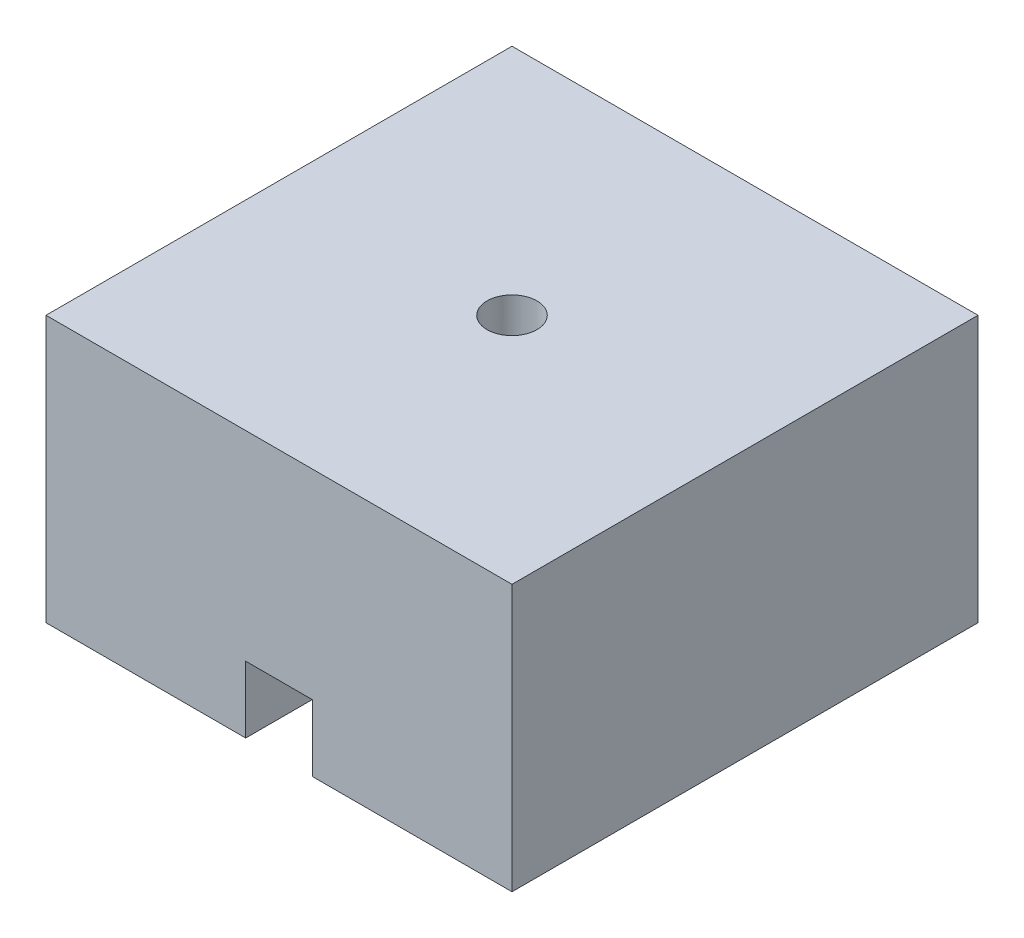
ISO-10303-21;
HEADER;
FILE_DESCRIPTION(('STEP AP214'),'2;1');
FILE_NAME('part.step','',(''),(''),'','','');
FILE_SCHEMA(('AUTOMOTIVE_DESIGN { 1 0 10303 214 1 1 1 1 }'));
ENDSEC;
DATA;
#1=APPLICATION_CONTEXT('core data for automotive mechanical design processes');
#2=APPLICATION_PROTOCOL_DEFINITION('international standard','automotive_design',2000,#1);
#3=PRODUCT_CONTEXT('',#1,'mechanical');
#4=PRODUCT('Part','Part','',(#3));
#5=PRODUCT_RELATED_PRODUCT_CATEGORY('part','',(#4));
#6=PRODUCT_DEFINITION_FORMATION('','',#4);
#7=PRODUCT_DEFINITION_CONTEXT('part definition',#1,'design');
#8=PRODUCT_DEFINITION('design','',#6,#7);
#9=PRODUCT_DEFINITION_SHAPE('','',#8);
#10=(LENGTH_UNIT() NAMED_UNIT(*) SI_UNIT(.MILLI.,.METRE.));
#11=(NAMED_UNIT(*) PLANE_ANGLE_UNIT() SI_UNIT($,.RADIAN.));
#12=(NAMED_UNIT(*) SI_UNIT($,.STERADIAN.) SOLID_ANGLE_UNIT());
#13=UNCERTAINTY_MEASURE_WITH_UNIT(LENGTH_MEASURE(1.E-05),#10,'distance_accuracy_value','');
#14=(GEOMETRIC_REPRESENTATION_CONTEXT(3) GLOBAL_UNCERTAINTY_ASSIGNED_CONTEXT((#13)) GLOBAL_UNIT_ASSIGNED_CONTEXT((#10,
#11,#12)) REPRESENTATION_CONTEXT('',''));
#15=CARTESIAN_POINT('',(0.,0.,0.));
#16=DIRECTION('',(0.,0.,1.));
#17=DIRECTION('',(1.,0.,0.));
#18=AXIS2_PLACEMENT_3D('',#15,#16,#17);
#19=CARTESIAN_POINT('',(0.,49.2125,0.));
#20=DIRECTION('',(0.,1.,0.));
#21=DIRECTION('',(0.,0.,1.));
#22=AXIS2_PLACEMENT_3D('',#19,#20,#21);
#23=PLANE('',#22);
#24=CARTESIAN_POINT('',(0.,49.2125,0.));
#25=DIRECTION('',(0.,-1.,0.));
#26=DIRECTION('',(0.,0.,-1.));
#27=AXIS2_PLACEMENT_3D('',#24,#25,#26);
#28=CIRCLE('',#27,7.9375);
#29=CARTESIAN_POINT('',(-6.35,49.2125,-4.7625));
#30=VERTEX_POINT('',#29);
#31=CARTESIAN_POINT('',(6.35,49.2125,-4.7625));
#32=VERTEX_POINT('',#31);
#33=EDGE_CURVE('E278',#30,#32,#28,.T.);
#34=ORIENTED_EDGE('',*,*,#33,.F.);
#35=DIRECTION('',(0.,0.,-1.));
#36=VECTOR('',#35,1.);
#37=CARTESIAN_POINT('',(-6.35,49.2125,34.925));
#38=LINE('',#37,#36);
#39=CARTESIAN_POINT('',(-6.35,49.2125,-34.925));
#40=VERTEX_POINT('',#39);
#41=EDGE_CURVE('E330',#30,#40,#38,.T.);
#42=ORIENTED_EDGE('',*,*,#41,.T.);
#43=DIRECTION('',(1.,0.,0.));
#44=VECTOR('',#43,1.);
#45=CARTESIAN_POINT('',(-6.35,49.2125,-34.925));
#46=LINE('',#45,#44);
#47=CARTESIAN_POINT('',(6.35,49.2125,-34.925));
#48=VERTEX_POINT('',#47);
#49=EDGE_CURVE('E321',#40,#48,#46,.T.);
#50=ORIENTED_EDGE('',*,*,#49,.T.);
#51=DIRECTION('',(0.,0.,1.));
#52=VECTOR('',#51,1.);
#53=CARTESIAN_POINT('',(6.34999999999999,49.2125,34.925));
#54=LINE('',#53,#52);
#55=EDGE_CURVE('E335',#48,#32,#54,.T.);
#56=ORIENTED_EDGE('',*,*,#55,.T.);
#57=EDGE_LOOP('',(#34,#42,#50,#56));
#58=FACE_BOUND('',#57,.T.);
#59=ADVANCED_FACE('F63',(#58),#23,.F.);
#60=CARTESIAN_POINT('',(6.35,49.2125,4.7625));
#61=VERTEX_POINT('',#60);
#62=CARTESIAN_POINT('',(-6.35,49.2125,4.7625));
#63=VERTEX_POINT('',#62);
#64=EDGE_CURVE('E284',#61,#63,#28,.T.);
#65=ORIENTED_EDGE('',*,*,#64,.F.);
#66=CARTESIAN_POINT('',(6.34999999999999,49.2125,34.925));
#67=VERTEX_POINT('',#66);
#68=EDGE_CURVE('E298',#61,#67,#54,.T.);
#69=ORIENTED_EDGE('',*,*,#68,.T.);
#70=DIRECTION('',(-1.,0.,0.));
#71=VECTOR('',#70,1.);
#72=CARTESIAN_POINT('',(-6.35,49.2125,34.925));
#73=LINE('',#72,#71);
#74=CARTESIAN_POINT('',(-6.35,49.2125,34.925));
#75=VERTEX_POINT('',#74);
#76=EDGE_CURVE('E331',#67,#75,#73,.T.);
#77=ORIENTED_EDGE('',*,*,#76,.T.);
#78=EDGE_CURVE('E326',#75,#63,#38,.T.);
#79=ORIENTED_EDGE('',*,*,#78,.T.);
#80=EDGE_LOOP('',(#65,#69,#77,#79));
#81=FACE_BOUND('',#80,.T.);
#82=ADVANCED_FACE('F527',(#81),#23,.F.);
#83=CARTESIAN_POINT('',(6.34999999999999,-74.7306245792179,34.925));
#84=DIRECTION('',(-1.,0.,0.));
#85=DIRECTION('',(0.,0.,1.));
#86=AXIS2_PLACEMENT_3D('',#83,#84,#85);
#87=PLANE('',#86);
#88=DIRECTION('',(0.,0.,1.));
#89=VECTOR('',#88,1.);
#90=CARTESIAN_POINT('',(6.35,12.7,0.));
#91=LINE('',#90,#89);
#92=CARTESIAN_POINT('',(6.35,12.7,34.925));
#93=VERTEX_POINT('',#92);
#94=CARTESIAN_POINT('',(6.35,12.7,44.45));
#95=VERTEX_POINT('',#94);
#96=EDGE_CURVE('E223',#93,#95,#91,.T.);
#97=ORIENTED_EDGE('',*,*,#96,.F.);
#98=DIRECTION('',(0.,1.,0.));
#99=VECTOR('',#98,1.);
#100=CARTESIAN_POINT('',(6.34999999999999,-74.7306245792179,34.925));
#101=LINE('',#100,#99);
#102=EDGE_CURVE('E303',#93,#67,#101,.T.);
#103=ORIENTED_EDGE('',*,*,#102,.T.);
#104=ORIENTED_EDGE('',*,*,#68,.F.);
#105=DIRECTION('',(0.,1.,0.));
#106=VECTOR('',#105,1.);
#107=CARTESIAN_POINT('',(6.35,42.8625,4.7625));
#108=LINE('',#107,#106);
#109=CARTESIAN_POINT('',(6.35,42.8625,4.7625));
#110=VERTEX_POINT('',#109);
#111=EDGE_CURVE('E291',#61,#110,#108,.F.);
#112=ORIENTED_EDGE('',*,*,#111,.T.);
#113=DIRECTION('',(0.,0.,1.));
#114=VECTOR('',#113,1.);
#115=CARTESIAN_POINT('',(6.34999999999999,42.8625,34.925));
#116=LINE('',#115,#114);
#117=CARTESIAN_POINT('',(6.35,42.8625,-4.7625));
#118=VERTEX_POINT('',#117);
#119=EDGE_CURVE('E295',#118,#110,#116,.T.);
#120=ORIENTED_EDGE('',*,*,#119,.F.);
#121=DIRECTION('',(0.,1.,0.));
#122=VECTOR('',#121,1.);
#123=CARTESIAN_POINT('',(6.35,42.8625,-4.7625));
#124=LINE('',#123,#122);
#125=EDGE_CURVE('E287',#118,#32,#124,.T.);
#126=ORIENTED_EDGE('',*,*,#125,.T.);
#127=ORIENTED_EDGE('',*,*,#55,.F.);
#128=DIRECTION('',(0.,1.,0.));
#129=VECTOR('',#128,1.);
#130=CARTESIAN_POINT('',(6.35,-74.7306245792179,-34.925));
#131=LINE('',#130,#129);
#132=CARTESIAN_POINT('',(6.35,0.,-34.925));
#133=VERTEX_POINT('',#132);
#134=EDGE_CURVE('E362',#133,#48,#131,.T.);
#135=ORIENTED_EDGE('',*,*,#134,.F.);
#136=DIRECTION('',(0.,0.,-1.));
#137=VECTOR('',#136,1.);
#138=CARTESIAN_POINT('',(6.34999999999999,0.,34.925));
#139=LINE('',#138,#137);
#140=CARTESIAN_POINT('',(6.35,0.,44.45));
#141=VERTEX_POINT('',#140);
#142=EDGE_CURVE('E238',#141,#133,#139,.T.);
#143=ORIENTED_EDGE('',*,*,#142,.F.);
#144=DIRECTION('',(0.,1.,0.));
#145=VECTOR('',#144,1.);
#146=CARTESIAN_POINT('',(6.35,0.,44.45));
#147=LINE('',#146,#145);
#148=EDGE_CURVE('E235',#141,#95,#147,.T.);
#149=ORIENTED_EDGE('',*,*,#148,.T.);
#150=EDGE_LOOP('',(#97,#103,#104,#112,#120,#126,#127,#135,#143,#149));
#151=FACE_BOUND('',#150,.T.);
#152=ADVANCED_FACE('F236',(#151),#87,.T.);
#153=CARTESIAN_POINT('',(-6.35,-74.7306245792179,34.925));
#154=DIRECTION('',(1.,0.,0.));
#155=DIRECTION('',(0.,0.,-1.));
#156=AXIS2_PLACEMENT_3D('',#153,#154,#155);
#157=PLANE('',#156);
#158=DIRECTION('',(0.,1.,0.));
#159=VECTOR('',#158,1.);
#160=CARTESIAN_POINT('',(-6.35,-74.7306245792179,34.925));
#161=LINE('',#160,#159);
#162=CARTESIAN_POINT('',(-6.35,12.7,34.925));
#163=VERTEX_POINT('',#162);
#164=EDGE_CURVE('E355',#163,#75,#161,.T.);
#165=ORIENTED_EDGE('',*,*,#164,.F.);
#166=DIRECTION('',(0.,0.,1.));
#167=VECTOR('',#166,1.);
#168=CARTESIAN_POINT('',(-6.35,12.7,0.));
#169=LINE('',#168,#167);
#170=CARTESIAN_POINT('',(-6.35,12.7,44.45));
#171=VERTEX_POINT('',#170);
#172=EDGE_CURVE('E78',#163,#171,#169,.T.);
#173=ORIENTED_EDGE('',*,*,#172,.T.);
#174=DIRECTION('',(0.,-1.,0.));
#175=VECTOR('',#174,1.);
#176=CARTESIAN_POINT('',(-6.35,0.,44.45));
#177=LINE('',#176,#175);
#178=CARTESIAN_POINT('',(-6.35,0.,44.45));
#179=VERTEX_POINT('',#178);
#180=EDGE_CURVE('E232',#171,#179,#177,.T.);
#181=ORIENTED_EDGE('',*,*,#180,.T.);
#182=DIRECTION('',(0.,0.,1.));
#183=VECTOR('',#182,1.);
#184=CARTESIAN_POINT('',(-6.35,0.,34.925));
#185=LINE('',#184,#183);
#186=CARTESIAN_POINT('',(-6.35,0.,-34.925));
#187=VERTEX_POINT('',#186);
#188=EDGE_CURVE('E342',#187,#179,#185,.T.);
#189=ORIENTED_EDGE('',*,*,#188,.F.);
#190=DIRECTION('',(0.,1.,0.));
#191=VECTOR('',#190,1.);
#192=CARTESIAN_POINT('',(-6.35,-74.7306245792179,-34.925));
#193=LINE('',#192,#191);
#194=EDGE_CURVE('E358',#187,#40,#193,.T.);
#195=ORIENTED_EDGE('',*,*,#194,.T.);
#196=ORIENTED_EDGE('',*,*,#41,.F.);
#197=DIRECTION('',(0.,1.,0.));
#198=VECTOR('',#197,1.);
#199=CARTESIAN_POINT('',(-6.35,42.8625,-4.7625));
#200=LINE('',#199,#198);
#201=CARTESIAN_POINT('',(-6.35,42.8625,-4.7625));
#202=VERTEX_POINT('',#201);
#203=EDGE_CURVE('E72',#30,#202,#200,.F.);
#204=ORIENTED_EDGE('',*,*,#203,.T.);
#205=DIRECTION('',(0.,0.,-1.));
#206=VECTOR('',#205,1.);
#207=CARTESIAN_POINT('',(-6.35,42.8625,34.925));
#208=LINE('',#207,#206);
#209=CARTESIAN_POINT('',(-6.35,42.8625,4.7625));
#210=VERTEX_POINT('',#209);
#211=EDGE_CURVE('E474',#210,#202,#208,.T.);
#212=ORIENTED_EDGE('',*,*,#211,.F.);
#213=DIRECTION('',(0.,1.,0.));
#214=VECTOR('',#213,1.);
#215=CARTESIAN_POINT('',(-6.35,42.8625,4.7625));
#216=LINE('',#215,#214);
#217=EDGE_CURVE('E470',#210,#63,#216,.T.);
#218=ORIENTED_EDGE('',*,*,#217,.T.);
#219=ORIENTED_EDGE('',*,*,#78,.F.);
#220=EDGE_LOOP('',(#165,#173,#181,#189,#195,#196,#204,#212,#218,#219));
#221=FACE_BOUND('',#220,.T.);
#222=ADVANCED_FACE('F482',(#221),#157,.T.);
#223=DIRECTION('',(0.,0.,-1.));
#224=VECTOR('',#223,1.);
#225=CARTESIAN_POINT('',(42.8625,49.2125,-44.45));
#226=LINE('',#225,#224);
#227=CARTESIAN_POINT('',(42.8625,49.2125,42.8625));
#228=VERTEX_POINT('',#227);
#229=CARTESIAN_POINT('',(42.8625,49.2125,-42.8625));
#230=VERTEX_POINT('',#229);
#231=EDGE_CURVE('E389',#228,#230,#226,.T.);
#232=ORIENTED_EDGE('',*,*,#231,.F.);
#233=DIRECTION('',(1.,0.,0.));
#234=VECTOR('',#233,1.);
#235=CARTESIAN_POINT('',(-44.45,49.2125,42.8625));
#236=LINE('',#235,#234);
#237=CARTESIAN_POINT('',(-42.8625,49.2125,42.8625));
#238=VERTEX_POINT('',#237);
#239=EDGE_CURVE('E400',#238,#228,#236,.T.);
#240=ORIENTED_EDGE('',*,*,#239,.F.);
#241=DIRECTION('',(0.,0.,1.));
#242=VECTOR('',#241,1.);
#243=CARTESIAN_POINT('',(-42.8625,49.2125,-44.45));
#244=LINE('',#243,#242);
#245=CARTESIAN_POINT('',(-42.8625,49.2125,-42.8625));
#246=VERTEX_POINT('',#245);
#247=EDGE_CURVE('E406',#246,#238,#244,.T.);
#248=ORIENTED_EDGE('',*,*,#247,.F.);
#249=DIRECTION('',(-1.,0.,0.));
#250=VECTOR('',#249,1.);
#251=CARTESIAN_POINT('',(-44.45,49.2125,-42.8625));
#252=LINE('',#251,#250);
#253=EDGE_CURVE('E393',#230,#246,#252,.T.);
#254=ORIENTED_EDGE('',*,*,#253,.F.);
#255=EDGE_LOOP('',(#232,#240,#248,#254));
#256=FACE_BOUND('',#255,.T.);
#257=DIRECTION('',(0.,0.,1.));
#258=VECTOR('',#257,1.);
#259=CARTESIAN_POINT('',(7.93749999999999,49.2125,34.925));
#260=LINE('',#259,#258);
#261=CARTESIAN_POINT('',(7.9375,49.2125,-36.5125));
#262=VERTEX_POINT('',#261);
#263=CARTESIAN_POINT('',(7.93749999999999,49.2125,36.5125));
#264=VERTEX_POINT('',#263);
#265=EDGE_CURVE('E316',#262,#264,#260,.T.);
#266=ORIENTED_EDGE('',*,*,#265,.F.);
#267=DIRECTION('',(1.,0.,0.));
#268=VECTOR('',#267,1.);
#269=CARTESIAN_POINT('',(-6.35,49.2125,-36.5125));
#270=LINE('',#269,#268);
#271=CARTESIAN_POINT('',(-7.9375,49.2125,-36.5125));
#272=VERTEX_POINT('',#271);
#273=EDGE_CURVE('E299',#272,#262,#270,.T.);
#274=ORIENTED_EDGE('',*,*,#273,.F.);
#275=DIRECTION('',(0.,0.,-1.));
#276=VECTOR('',#275,1.);
#277=CARTESIAN_POINT('',(-7.93750000000001,49.2125,34.925));
#278=LINE('',#277,#276);
#279=CARTESIAN_POINT('',(-7.93750000000001,49.2125,36.5125));
#280=VERTEX_POINT('',#279);
#281=EDGE_CURVE('E305',#280,#272,#278,.T.);
#282=ORIENTED_EDGE('',*,*,#281,.F.);
#283=DIRECTION('',(-1.,0.,0.));
#284=VECTOR('',#283,1.);
#285=CARTESIAN_POINT('',(-6.35,49.2125,36.5125));
#286=LINE('',#285,#284);
#287=EDGE_CURVE('E310',#264,#280,#286,.T.);
#288=ORIENTED_EDGE('',*,*,#287,.F.);
#289=EDGE_LOOP('',(#266,#274,#282,#288));
#290=FACE_BOUND('',#289,.T.);
#291=ADVANCED_FACE('F557',(#256,#290),#23,.F.);
#292=CARTESIAN_POINT('',(44.45,50.8,-44.45));
#293=DIRECTION('',(-1.,0.,0.));
#294=DIRECTION('',(0.,0.,1.));
#295=AXIS2_PLACEMENT_3D('',#292,#293,#294);
#296=PLANE('',#295);
#297=DIRECTION('',(0.,0.,-1.));
#298=VECTOR('',#297,1.);
#299=CARTESIAN_POINT('',(44.45,0.,-44.45));
#300=LINE('',#299,#298);
#301=CARTESIAN_POINT('',(44.45,0.,44.45));
#302=VERTEX_POINT('',#301);
#303=CARTESIAN_POINT('',(44.45,0.,-44.45));
#304=VERTEX_POINT('',#303);
#305=EDGE_CURVE('E387',#302,#304,#300,.T.);
#306=ORIENTED_EDGE('',*,*,#305,.T.);
#307=DIRECTION('',(0.,-1.,0.));
#308=VECTOR('',#307,1.);
#309=CARTESIAN_POINT('',(44.45,50.8,-44.45));
#310=LINE('',#309,#308);
#311=CARTESIAN_POINT('',(44.45,50.8,-44.45));
#312=VERTEX_POINT('',#311);
#313=EDGE_CURVE('E466',#312,#304,#310,.T.);
#314=ORIENTED_EDGE('',*,*,#313,.F.);
#315=DIRECTION('',(0.,0.,-1.));
#316=VECTOR('',#315,1.);
#317=CARTESIAN_POINT('',(44.45,50.8,-44.45));
#318=LINE('',#317,#316);
#319=CARTESIAN_POINT('',(44.45,50.8,44.45));
#320=VERTEX_POINT('',#319);
#321=EDGE_CURVE('E428',#320,#312,#318,.T.);
#322=ORIENTED_EDGE('',*,*,#321,.F.);
#323=DIRECTION('',(0.,-1.,0.));
#324=VECTOR('',#323,1.);
#325=CARTESIAN_POINT('',(44.45,50.8,44.45));
#326=LINE('',#325,#324);
#327=EDGE_CURVE('E442',#320,#302,#326,.T.);
#328=ORIENTED_EDGE('',*,*,#327,.T.);
#329=EDGE_LOOP('',(#306,#314,#322,#328));
#330=FACE_BOUND('',#329,.T.);
#331=ADVANCED_FACE('F65',(#330),#296,.F.);
#332=CARTESIAN_POINT('',(-44.45,50.8,-44.45));
#333=DIRECTION('',(0.,0.,1.));
#334=DIRECTION('',(1.,0.,0.));
#335=AXIS2_PLACEMENT_3D('',#332,#333,#334);
#336=PLANE('',#335);
#337=DIRECTION('',(-1.,0.,0.));
#338=VECTOR('',#337,1.);
#339=CARTESIAN_POINT('',(-44.45,0.,-44.45));
#340=LINE('',#339,#338);
#341=CARTESIAN_POINT('',(-44.45,0.,-44.45));
#342=VERTEX_POINT('',#341);
#343=EDGE_CURVE('E446',#304,#342,#340,.T.);
#344=ORIENTED_EDGE('',*,*,#343,.T.);
#345=DIRECTION('',(0.,-1.,0.));
#346=VECTOR('',#345,1.);
#347=CARTESIAN_POINT('',(-44.45,50.8,-44.45));
#348=LINE('',#347,#346);
#349=CARTESIAN_POINT('',(-44.45,50.8,-44.45));
#350=VERTEX_POINT('',#349);
#351=EDGE_CURVE('E462',#350,#342,#348,.T.);
#352=ORIENTED_EDGE('',*,*,#351,.F.);
#353=DIRECTION('',(-1.,0.,0.));
#354=VECTOR('',#353,1.);
#355=CARTESIAN_POINT('',(-44.45,50.8,-44.45));
#356=LINE('',#355,#354);
#357=EDGE_CURVE('E432',#312,#350,#356,.T.);
#358=ORIENTED_EDGE('',*,*,#357,.F.);
#359=ORIENTED_EDGE('',*,*,#313,.T.);
#360=EDGE_LOOP('',(#344,#352,#358,#359));
#361=FACE_BOUND('',#360,.T.);
#362=ADVANCED_FACE('F507',(#361),#336,.F.);
#363=CARTESIAN_POINT('',(-44.45,50.8,-44.45));
#364=DIRECTION('',(1.,0.,0.));
#365=DIRECTION('',(0.,0.,-1.));
#366=AXIS2_PLACEMENT_3D('',#363,#364,#365);
#367=PLANE('',#366);
#368=DIRECTION('',(0.,0.,1.));
#369=VECTOR('',#368,1.);
#370=CARTESIAN_POINT('',(-44.45,0.,-44.45));
#371=LINE('',#370,#369);
#372=CARTESIAN_POINT('',(-44.45,0.,44.45));
#373=VERTEX_POINT('',#372);
#374=EDGE_CURVE('E449',#342,#373,#371,.T.);
#375=ORIENTED_EDGE('',*,*,#374,.T.);
#376=DIRECTION('',(0.,-1.,0.));
#377=VECTOR('',#376,1.);
#378=CARTESIAN_POINT('',(-44.45,50.8,44.45));
#379=LINE('',#378,#377);
#380=CARTESIAN_POINT('',(-44.45,50.8,44.45));
#381=VERTEX_POINT('',#380);
#382=EDGE_CURVE('E458',#381,#373,#379,.T.);
#383=ORIENTED_EDGE('',*,*,#382,.F.);
#384=DIRECTION('',(0.,0.,1.));
#385=VECTOR('',#384,1.);
#386=CARTESIAN_POINT('',(-44.45,50.8,-44.45));
#387=LINE('',#386,#385);
#388=EDGE_CURVE('E436',#350,#381,#387,.T.);
#389=ORIENTED_EDGE('',*,*,#388,.F.);
#390=ORIENTED_EDGE('',*,*,#351,.T.);
#391=EDGE_LOOP('',(#375,#383,#389,#390));
#392=FACE_BOUND('',#391,.T.);
#393=ADVANCED_FACE('F503',(#392),#367,.F.);
#394=CARTESIAN_POINT('',(-44.45,50.8,44.45));
#395=DIRECTION('',(0.,0.,-1.));
#396=DIRECTION('',(-1.,0.,0.));
#397=AXIS2_PLACEMENT_3D('',#394,#395,#396);
#398=PLANE('',#397);
#399=DIRECTION('',(-1.,0.,0.));
#400=VECTOR('',#399,1.);
#401=CARTESIAN_POINT('',(6.35,12.7,44.45));
#402=LINE('',#401,#400);
#403=EDGE_CURVE('E227',#95,#171,#402,.T.);
#404=ORIENTED_EDGE('',*,*,#403,.F.);
#405=ORIENTED_EDGE('',*,*,#148,.F.);
#406=DIRECTION('',(1.,0.,0.));
#407=VECTOR('',#406,1.);
#408=CARTESIAN_POINT('',(-44.45,0.,44.45));
#409=LINE('',#408,#407);
#410=EDGE_CURVE('E452',#141,#302,#409,.T.);
#411=ORIENTED_EDGE('',*,*,#410,.T.);
#412=ORIENTED_EDGE('',*,*,#327,.F.);
#413=DIRECTION('',(1.,0.,0.));
#414=VECTOR('',#413,1.);
#415=CARTESIAN_POINT('',(-44.45,50.8,44.45));
#416=LINE('',#415,#414);
#417=EDGE_CURVE('E439',#381,#320,#416,.T.);
#418=ORIENTED_EDGE('',*,*,#417,.F.);
#419=ORIENTED_EDGE('',*,*,#382,.T.);
#420=EDGE_CURVE('E433',#373,#179,#409,.T.);
#421=ORIENTED_EDGE('',*,*,#420,.T.);
#422=ORIENTED_EDGE('',*,*,#180,.F.);
#423=EDGE_LOOP('',(#404,#405,#411,#412,#418,#419,#421,#422));
#424=FACE_BOUND('',#423,.T.);
#425=ADVANCED_FACE('F243',(#424),#398,.F.);
#426=CARTESIAN_POINT('',(0.,50.8,0.));
#427=DIRECTION('',(0.,1.,0.));
#428=DIRECTION('',(0.,0.,1.));
#429=AXIS2_PLACEMENT_3D('',#426,#427,#428);
#430=PLANE('',#429);
#431=CARTESIAN_POINT('',(0.,50.8,0.));
#432=DIRECTION('',(0.,1.,0.));
#433=DIRECTION('',(0.,0.,1.));
#434=AXIS2_PLACEMENT_3D('',#431,#432,#433);
#435=CIRCLE('',#434,4.7625);
#436=CARTESIAN_POINT('',(0.,50.8,4.7625));
#437=VERTEX_POINT('',#436);
#438=EDGE_CURVE('E378',#437,#437,#435,.T.);
#439=ORIENTED_EDGE('',*,*,#438,.F.);
#440=EDGE_LOOP('',(#439));
#441=FACE_BOUND('',#440,.T.);
#442=ORIENTED_EDGE('',*,*,#321,.T.);
#443=ORIENTED_EDGE('',*,*,#357,.T.);
#444=ORIENTED_EDGE('',*,*,#388,.T.);
#445=ORIENTED_EDGE('',*,*,#417,.T.);
#446=EDGE_LOOP('',(#442,#443,#444,#445));
#447=FACE_BOUND('',#446,.T.);
#448=ADVANCED_FACE('F607',(#441,#447),#430,.T.);
#449=CARTESIAN_POINT('',(0.,0.,0.));
#450=DIRECTION('',(0.,1.,0.));
#451=DIRECTION('',(0.,0.,1.));
#452=AXIS2_PLACEMENT_3D('',#449,#450,#451);
#453=PLANE('',#452);
#454=DIRECTION('',(1.,0.,0.));
#455=VECTOR('',#454,1.);
#456=CARTESIAN_POINT('',(-44.45,0.,42.8625));
#457=LINE('',#456,#455);
#458=CARTESIAN_POINT('',(-42.8625,0.,42.8625));
#459=VERTEX_POINT('',#458);
#460=CARTESIAN_POINT('',(-7.9375,0.,42.8625));
#461=VERTEX_POINT('',#460);
#462=EDGE_CURVE('E394',#459,#461,#457,.T.);
#463=ORIENTED_EDGE('',*,*,#462,.T.);
#464=DIRECTION('',(0.,0.,1.));
#465=VECTOR('',#464,1.);
#466=CARTESIAN_POINT('',(-7.93750000000001,0.,34.925));
#467=LINE('',#466,#465);
#468=CARTESIAN_POINT('',(-7.9375,0.,-36.5125));
#469=VERTEX_POINT('',#468);
#470=EDGE_CURVE('E314',#469,#461,#467,.T.);
#471=ORIENTED_EDGE('',*,*,#470,.F.);
#472=DIRECTION('',(-1.,0.,0.));
#473=VECTOR('',#472,1.);
#474=CARTESIAN_POINT('',(-6.35,0.,-36.5125));
#475=LINE('',#474,#473);
#476=CARTESIAN_POINT('',(7.9375,0.,-36.5125));
#477=VERTEX_POINT('',#476);
#478=EDGE_CURVE('E308',#477,#469,#475,.T.);
#479=ORIENTED_EDGE('',*,*,#478,.F.);
#480=DIRECTION('',(0.,0.,-1.));
#481=VECTOR('',#480,1.);
#482=CARTESIAN_POINT('',(7.93749999999999,0.,34.925));
#483=LINE('',#482,#481);
#484=CARTESIAN_POINT('',(7.9375,0.,42.8625));
#485=VERTEX_POINT('',#484);
#486=EDGE_CURVE('E325',#485,#477,#483,.T.);
#487=ORIENTED_EDGE('',*,*,#486,.F.);
#488=CARTESIAN_POINT('',(42.8625,0.,42.8625));
#489=VERTEX_POINT('',#488);
#490=EDGE_CURVE('E420',#485,#489,#457,.T.);
#491=ORIENTED_EDGE('',*,*,#490,.T.);
#492=DIRECTION('',(0.,0.,-1.));
#493=VECTOR('',#492,1.);
#494=CARTESIAN_POINT('',(42.8625,0.,-44.45));
#495=LINE('',#494,#493);
#496=CARTESIAN_POINT('',(42.8625,0.,-42.8625));
#497=VERTEX_POINT('',#496);
#498=EDGE_CURVE('E382',#489,#497,#495,.T.);
#499=ORIENTED_EDGE('',*,*,#498,.T.);
#500=DIRECTION('',(-1.,0.,0.));
#501=VECTOR('',#500,1.);
#502=CARTESIAN_POINT('',(-44.45,0.,-42.8625));
#503=LINE('',#502,#501);
#504=CARTESIAN_POINT('',(-42.8625,0.,-42.8625));
#505=VERTEX_POINT('',#504);
#506=EDGE_CURVE('E416',#497,#505,#503,.T.);
#507=ORIENTED_EDGE('',*,*,#506,.T.);
#508=DIRECTION('',(0.,0.,1.));
#509=VECTOR('',#508,1.);
#510=CARTESIAN_POINT('',(-42.8625,0.,-44.45));
#511=LINE('',#510,#509);
#512=EDGE_CURVE('E421',#505,#459,#511,.T.);
#513=ORIENTED_EDGE('',*,*,#512,.T.);
#514=EDGE_LOOP('',(#463,#471,#479,#487,#491,#499,#507,#513));
#515=FACE_BOUND('',#514,.T.);
#516=ORIENTED_EDGE('',*,*,#410,.F.);
#517=ORIENTED_EDGE('',*,*,#142,.T.);
#518=DIRECTION('',(-1.,0.,0.));
#519=VECTOR('',#518,1.);
#520=CARTESIAN_POINT('',(-6.35,0.,-34.925));
#521=LINE('',#520,#519);
#522=EDGE_CURVE('E339',#133,#187,#521,.T.);
#523=ORIENTED_EDGE('',*,*,#522,.T.);
#524=ORIENTED_EDGE('',*,*,#188,.T.);
#525=ORIENTED_EDGE('',*,*,#420,.F.);
#526=ORIENTED_EDGE('',*,*,#374,.F.);
#527=ORIENTED_EDGE('',*,*,#343,.F.);
#528=ORIENTED_EDGE('',*,*,#305,.F.);
#529=EDGE_LOOP('',(#516,#517,#523,#524,#525,#526,#527,#528));
#530=FACE_BOUND('',#529,.T.);
#531=ADVANCED_FACE('F496',(#515,#530),#453,.F.);
#532=CARTESIAN_POINT('',(42.8625,50.8,-44.45));
#533=DIRECTION('',(-1.,0.,0.));
#534=DIRECTION('',(0.,0.,1.));
#535=AXIS2_PLACEMENT_3D('',#532,#533,#534);
#536=PLANE('',#535);
#537=ORIENTED_EDGE('',*,*,#498,.F.);
#538=DIRECTION('',(0.,-1.,0.));
#539=VECTOR('',#538,1.);
#540=CARTESIAN_POINT('',(42.8625,50.8,42.8625));
#541=LINE('',#540,#539);
#542=EDGE_CURVE('E395',#228,#489,#541,.T.);
#543=ORIENTED_EDGE('',*,*,#542,.F.);
#544=ORIENTED_EDGE('',*,*,#231,.T.);
#545=DIRECTION('',(0.,-1.,0.));
#546=VECTOR('',#545,1.);
#547=CARTESIAN_POINT('',(42.8625,50.8,-42.8625));
#548=LINE('',#547,#546);
#549=EDGE_CURVE('E383',#230,#497,#548,.T.);
#550=ORIENTED_EDGE('',*,*,#549,.T.);
#551=EDGE_LOOP('',(#537,#543,#544,#550));
#552=FACE_BOUND('',#551,.T.);
#553=ADVANCED_FACE('F599',(#552),#536,.T.);
#554=CARTESIAN_POINT('',(-44.45,50.8,-42.8625));
#555=DIRECTION('',(0.,0.,1.));
#556=DIRECTION('',(1.,0.,0.));
#557=AXIS2_PLACEMENT_3D('',#554,#555,#556);
#558=PLANE('',#557);
#559=ORIENTED_EDGE('',*,*,#506,.F.);
#560=ORIENTED_EDGE('',*,*,#549,.F.);
#561=ORIENTED_EDGE('',*,*,#253,.T.);
#562=DIRECTION('',(0.,-1.,0.));
#563=VECTOR('',#562,1.);
#564=CARTESIAN_POINT('',(-42.8625,50.8,-42.8625));
#565=LINE('',#564,#563);
#566=EDGE_CURVE('E388',#246,#505,#565,.T.);
#567=ORIENTED_EDGE('',*,*,#566,.T.);
#568=EDGE_LOOP('',(#559,#560,#561,#567));
#569=FACE_BOUND('',#568,.T.);
#570=ADVANCED_FACE('F594',(#569),#558,.T.);
#571=CARTESIAN_POINT('',(-42.8625,50.8,-44.45));
#572=DIRECTION('',(1.,0.,0.));
#573=DIRECTION('',(0.,0.,-1.));
#574=AXIS2_PLACEMENT_3D('',#571,#572,#573);
#575=PLANE('',#574);
#576=ORIENTED_EDGE('',*,*,#512,.F.);
#577=ORIENTED_EDGE('',*,*,#566,.F.);
#578=ORIENTED_EDGE('',*,*,#247,.T.);
#579=DIRECTION('',(0.,-1.,0.));
#580=VECTOR('',#579,1.);
#581=CARTESIAN_POINT('',(-42.8625,50.8,42.8625));
#582=LINE('',#581,#580);
#583=EDGE_CURVE('E399',#238,#459,#582,.T.);
#584=ORIENTED_EDGE('',*,*,#583,.T.);
#585=EDGE_LOOP('',(#576,#577,#578,#584));
#586=FACE_BOUND('',#585,.T.);
#587=ADVANCED_FACE('F551',(#586),#575,.T.);
#588=CARTESIAN_POINT('',(-44.45,50.8,42.8625));
#589=DIRECTION('',(0.,0.,-1.));
#590=DIRECTION('',(-1.,0.,0.));
#591=AXIS2_PLACEMENT_3D('',#588,#589,#590);
#592=PLANE('',#591);
#593=DIRECTION('',(0.,1.,0.));
#594=VECTOR('',#593,1.);
#595=CARTESIAN_POINT('',(-7.9375,50.8,42.8625));
#596=LINE('',#595,#594);
#597=CARTESIAN_POINT('',(-7.9375,14.2875,42.8625));
#598=VERTEX_POINT('',#597);
#599=EDGE_CURVE('E269',#461,#598,#596,.T.);
#600=ORIENTED_EDGE('',*,*,#599,.F.);
#601=ORIENTED_EDGE('',*,*,#462,.F.);
#602=ORIENTED_EDGE('',*,*,#583,.F.);
#603=ORIENTED_EDGE('',*,*,#239,.T.);
#604=ORIENTED_EDGE('',*,*,#542,.T.);
#605=ORIENTED_EDGE('',*,*,#490,.F.);
#606=DIRECTION('',(0.,-1.,0.));
#607=VECTOR('',#606,1.);
#608=CARTESIAN_POINT('',(7.9375,50.8,42.8625));
#609=LINE('',#608,#607);
#610=CARTESIAN_POINT('',(7.9375,14.2875,42.8625));
#611=VERTEX_POINT('',#610);
#612=EDGE_CURVE('E265',#611,#485,#609,.T.);
#613=ORIENTED_EDGE('',*,*,#612,.F.);
#614=DIRECTION('',(1.,0.,0.));
#615=VECTOR('',#614,1.);
#616=CARTESIAN_POINT('',(-44.45,14.2875,42.8625));
#617=LINE('',#616,#615);
#618=EDGE_CURVE('E86',#598,#611,#617,.T.);
#619=ORIENTED_EDGE('',*,*,#618,.F.);
#620=EDGE_LOOP('',(#600,#601,#602,#603,#604,#605,#613,#619));
#621=FACE_BOUND('',#620,.T.);
#622=ADVANCED_FACE('F541',(#621),#592,.T.);
#623=CARTESIAN_POINT('',(0.,0.,0.));
#624=DIRECTION('',(0.,1.,0.));
#625=DIRECTION('',(0.,0.,1.));
#626=AXIS2_PLACEMENT_3D('',#623,#624,#625);
#627=CYLINDRICAL_SURFACE('',#626,4.7625);
#628=ORIENTED_EDGE('',*,*,#438,.T.);
#629=EDGE_LOOP('',(#628));
#630=FACE_BOUND('',#629,.T.);
#631=CARTESIAN_POINT('',(0.,42.8625,0.));
#632=DIRECTION('',(0.,-1.,0.));
#633=DIRECTION('',(0.,0.,-1.));
#634=AXIS2_PLACEMENT_3D('',#631,#632,#633);
#635=CIRCLE('',#634,4.7625);
#636=CARTESIAN_POINT('',(0.,42.8625,-4.7625));
#637=VERTEX_POINT('',#636);
#638=EDGE_CURVE('E274',#637,#637,#635,.T.);
#639=ORIENTED_EDGE('',*,*,#638,.T.);
#640=EDGE_LOOP('',(#639));
#641=FACE_BOUND('',#640,.T.);
#642=ADVANCED_FACE('F538',(#630,#641),#627,.F.);
#643=CARTESIAN_POINT('',(7.93749999999999,-74.7306245792179,34.925));
#644=DIRECTION('',(-1.,0.,0.));
#645=DIRECTION('',(0.,0.,1.));
#646=AXIS2_PLACEMENT_3D('',#643,#644,#645);
#647=PLANE('',#646);
#648=DIRECTION('',(0.,1.,0.));
#649=VECTOR('',#648,1.);
#650=CARTESIAN_POINT('',(7.93749999999999,-74.7306245792179,36.5125));
#651=LINE('',#650,#649);
#652=CARTESIAN_POINT('',(7.93749999999999,14.2875,36.5125));
#653=VERTEX_POINT('',#652);
#654=EDGE_CURVE('E315',#653,#264,#651,.T.);
#655=ORIENTED_EDGE('',*,*,#654,.F.);
#656=DIRECTION('',(0.,0.,1.));
#657=VECTOR('',#656,1.);
#658=CARTESIAN_POINT('',(7.9375,14.2875,15.1548718252705));
#659=LINE('',#658,#657);
#660=EDGE_CURVE('E261',#653,#611,#659,.T.);
#661=ORIENTED_EDGE('',*,*,#660,.T.);
#662=ORIENTED_EDGE('',*,*,#612,.T.);
#663=ORIENTED_EDGE('',*,*,#486,.T.);
#664=DIRECTION('',(0.,1.,0.));
#665=VECTOR('',#664,1.);
#666=CARTESIAN_POINT('',(7.9375,-74.7306245792179,-36.5125));
#667=LINE('',#666,#665);
#668=EDGE_CURVE('E320',#477,#262,#667,.T.);
#669=ORIENTED_EDGE('',*,*,#668,.T.);
#670=ORIENTED_EDGE('',*,*,#265,.T.);
#671=EDGE_LOOP('',(#655,#661,#662,#663,#669,#670));
#672=FACE_BOUND('',#671,.T.);
#673=ADVANCED_FACE('F540',(#672),#647,.F.);
#674=CARTESIAN_POINT('',(-6.35,-74.7306245792179,36.5125));
#675=DIRECTION('',(0.,0.,-1.));
#676=DIRECTION('',(-1.,0.,0.));
#677=AXIS2_PLACEMENT_3D('',#674,#675,#676);
#678=PLANE('',#677);
#679=DIRECTION('',(0.,1.,0.));
#680=VECTOR('',#679,1.);
#681=CARTESIAN_POINT('',(-7.93750000000001,-74.7306245792179,36.5125));
#682=LINE('',#681,#680);
#683=CARTESIAN_POINT('',(-7.93750000000001,14.2875,36.5125));
#684=VERTEX_POINT('',#683);
#685=EDGE_CURVE('E309',#684,#280,#682,.T.);
#686=ORIENTED_EDGE('',*,*,#685,.F.);
#687=DIRECTION('',(-1.,0.,0.));
#688=VECTOR('',#687,1.);
#689=CARTESIAN_POINT('',(7.9375,14.2875,36.5125));
#690=LINE('',#689,#688);
#691=EDGE_CURVE('E252',#653,#684,#690,.T.);
#692=ORIENTED_EDGE('',*,*,#691,.F.);
#693=ORIENTED_EDGE('',*,*,#654,.T.);
#694=ORIENTED_EDGE('',*,*,#287,.T.);
#695=EDGE_LOOP('',(#686,#692,#693,#694));
#696=FACE_BOUND('',#695,.T.);
#697=ADVANCED_FACE('F548',(#696),#678,.F.);
#698=CARTESIAN_POINT('',(-7.93750000000001,-74.7306245792179,34.925));
#699=DIRECTION('',(1.,0.,0.));
#700=DIRECTION('',(0.,0.,-1.));
#701=AXIS2_PLACEMENT_3D('',#698,#699,#700);
#702=PLANE('',#701);
#703=DIRECTION('',(0.,1.,0.));
#704=VECTOR('',#703,1.);
#705=CARTESIAN_POINT('',(-7.9375,-74.7306245792179,-36.5125));
#706=LINE('',#705,#704);
#707=EDGE_CURVE('E304',#469,#272,#706,.T.);
#708=ORIENTED_EDGE('',*,*,#707,.F.);
#709=ORIENTED_EDGE('',*,*,#470,.T.);
#710=ORIENTED_EDGE('',*,*,#599,.T.);
#711=DIRECTION('',(0.,0.,1.));
#712=VECTOR('',#711,1.);
#713=CARTESIAN_POINT('',(-7.9375,14.2875,15.1548718252705));
#714=LINE('',#713,#712);
#715=EDGE_CURVE('E257',#684,#598,#714,.T.);
#716=ORIENTED_EDGE('',*,*,#715,.F.);
#717=ORIENTED_EDGE('',*,*,#685,.T.);
#718=ORIENTED_EDGE('',*,*,#281,.T.);
#719=EDGE_LOOP('',(#708,#709,#710,#716,#717,#718));
#720=FACE_BOUND('',#719,.T.);
#721=ADVANCED_FACE('F581',(#720),#702,.F.);
#722=CARTESIAN_POINT('',(-6.35,-74.7306245792179,-36.5125));
#723=DIRECTION('',(0.,0.,1.));
#724=DIRECTION('',(1.,0.,0.));
#725=AXIS2_PLACEMENT_3D('',#722,#723,#724);
#726=PLANE('',#725);
#727=ORIENTED_EDGE('',*,*,#668,.F.);
#728=ORIENTED_EDGE('',*,*,#478,.T.);
#729=ORIENTED_EDGE('',*,*,#707,.T.);
#730=ORIENTED_EDGE('',*,*,#273,.T.);
#731=EDGE_LOOP('',(#727,#728,#729,#730));
#732=FACE_BOUND('',#731,.T.);
#733=ADVANCED_FACE('F578',(#732),#726,.F.);
#734=CARTESIAN_POINT('',(-6.35,-74.7306245792179,34.925));
#735=DIRECTION('',(0.,0.,-1.));
#736=DIRECTION('',(-1.,0.,0.));
#737=AXIS2_PLACEMENT_3D('',#734,#735,#736);
#738=PLANE('',#737);
#739=DIRECTION('',(1.,0.,0.));
#740=VECTOR('',#739,1.);
#741=CARTESIAN_POINT('',(-6.35,12.7,34.925));
#742=LINE('',#741,#740);
#743=EDGE_CURVE('E12',#163,#93,#742,.T.);
#744=ORIENTED_EDGE('',*,*,#743,.F.);
#745=ORIENTED_EDGE('',*,*,#164,.T.);
#746=ORIENTED_EDGE('',*,*,#76,.F.);
#747=ORIENTED_EDGE('',*,*,#102,.F.);
#748=EDGE_LOOP('',(#744,#745,#746,#747));
#749=FACE_BOUND('',#748,.T.);
#750=ADVANCED_FACE('F530',(#749),#738,.T.);
#751=CARTESIAN_POINT('',(-6.35,-74.7306245792179,-34.925));
#752=DIRECTION('',(0.,0.,1.));
#753=DIRECTION('',(1.,0.,0.));
#754=AXIS2_PLACEMENT_3D('',#751,#752,#753);
#755=PLANE('',#754);
#756=ORIENTED_EDGE('',*,*,#522,.F.);
#757=ORIENTED_EDGE('',*,*,#134,.T.);
#758=ORIENTED_EDGE('',*,*,#49,.F.);
#759=ORIENTED_EDGE('',*,*,#194,.F.);
#760=EDGE_LOOP('',(#756,#757,#758,#759));
#761=FACE_BOUND('',#760,.T.);
#762=ADVANCED_FACE('F492',(#761),#755,.T.);
#763=CARTESIAN_POINT('',(0.,42.8625,0.));
#764=DIRECTION('',(0.,1.,0.));
#765=DIRECTION('',(0.,0.,1.));
#766=AXIS2_PLACEMENT_3D('',#763,#764,#765);
#767=CYLINDRICAL_SURFACE('',#766,7.9375);
#768=ORIENTED_EDGE('',*,*,#111,.F.);
#769=ORIENTED_EDGE('',*,*,#64,.T.);
#770=ORIENTED_EDGE('',*,*,#217,.F.);
#771=CARTESIAN_POINT('',(0.,42.8625,0.));
#772=DIRECTION('',(0.,-1.,0.));
#773=DIRECTION('',(0.,0.,-1.));
#774=AXIS2_PLACEMENT_3D('',#771,#772,#773);
#775=CIRCLE('',#774,7.9375);
#776=EDGE_CURVE('E283',#110,#210,#775,.T.);
#777=ORIENTED_EDGE('',*,*,#776,.F.);
#778=EDGE_LOOP('',(#768,#769,#770,#777));
#779=FACE_BOUND('',#778,.T.);
#780=ADVANCED_FACE('F522',(#779),#767,.T.);
#781=CARTESIAN_POINT('',(0.,42.8625,0.));
#782=DIRECTION('',(0.,-1.,0.));
#783=DIRECTION('',(0.,0.,-1.));
#784=AXIS2_PLACEMENT_3D('',#781,#782,#783);
#785=PLANE('',#784);
#786=EDGE_CURVE('E279',#202,#118,#775,.T.);
#787=ORIENTED_EDGE('',*,*,#786,.T.);
#788=ORIENTED_EDGE('',*,*,#119,.T.);
#789=ORIENTED_EDGE('',*,*,#776,.T.);
#790=ORIENTED_EDGE('',*,*,#211,.T.);
#791=EDGE_LOOP('',(#787,#788,#789,#790));
#792=FACE_BOUND('',#791,.T.);
#793=ORIENTED_EDGE('',*,*,#638,.F.);
#794=EDGE_LOOP('',(#793));
#795=FACE_BOUND('',#794,.T.);
#796=ADVANCED_FACE('F532',(#792,#795),#785,.T.);
#797=ORIENTED_EDGE('',*,*,#125,.F.);
#798=ORIENTED_EDGE('',*,*,#786,.F.);
#799=ORIENTED_EDGE('',*,*,#203,.F.);
#800=ORIENTED_EDGE('',*,*,#33,.T.);
#801=EDGE_LOOP('',(#797,#798,#799,#800));
#802=FACE_BOUND('',#801,.T.);
#803=ADVANCED_FACE('F486',(#802),#767,.T.);
#804=CARTESIAN_POINT('',(7.9375,14.2875,15.1548718252705));
#805=DIRECTION('',(0.,1.,0.));
#806=DIRECTION('',(0.,0.,1.));
#807=AXIS2_PLACEMENT_3D('',#804,#805,#806);
#808=PLANE('',#807);
#809=ORIENTED_EDGE('',*,*,#715,.T.);
#810=ORIENTED_EDGE('',*,*,#618,.T.);
#811=ORIENTED_EDGE('',*,*,#660,.F.);
#812=ORIENTED_EDGE('',*,*,#691,.T.);
#813=EDGE_LOOP('',(#809,#810,#811,#812));
#814=FACE_BOUND('',#813,.T.);
#815=ADVANCED_FACE('F586',(#814),#808,.T.);
#816=CARTESIAN_POINT('',(6.35,12.7,0.));
#817=DIRECTION('',(0.,1.,0.));
#818=DIRECTION('',(0.,0.,1.));
#819=AXIS2_PLACEMENT_3D('',#816,#817,#818);
#820=PLANE('',#819);
#821=ORIENTED_EDGE('',*,*,#743,.T.);
#822=ORIENTED_EDGE('',*,*,#96,.T.);
#823=ORIENTED_EDGE('',*,*,#403,.T.);
#824=ORIENTED_EDGE('',*,*,#172,.F.);
#825=EDGE_LOOP('',(#821,#822,#823,#824));
#826=FACE_BOUND('',#825,.T.);
#827=ADVANCED_FACE('F225',(#826),#820,.F.);
#828=CLOSED_SHELL('',(#59,#82,#152,#222,#291,#331,#362,#393,#425,#448,#531,#553,#570,#587,#622,
#642,#673,#697,#721,#733,#750,#762,#780,#796,#803,#815,#827));
#829=MANIFOLD_SOLID_BREP('B2',#828);
#830=ADVANCED_BREP_SHAPE_REPRESENTATION('',(#18,#829),#14);
#831=SHAPE_DEFINITION_REPRESENTATION(#9,#830);
ENDSEC;
END-ISO-10303-21;
